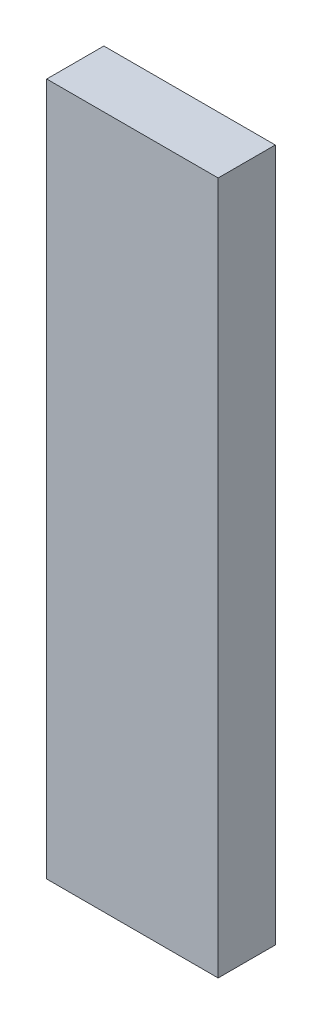
ISO-10303-21;
HEADER;
FILE_DESCRIPTION(('STEP AP214'),'2;1');
FILE_NAME('part.step','',(''),(''),'','','');
FILE_SCHEMA(('AUTOMOTIVE_DESIGN { 1 0 10303 214 1 1 1 1 }'));
ENDSEC;
DATA;
#1=APPLICATION_CONTEXT('core data for automotive mechanical design processes');
#2=APPLICATION_PROTOCOL_DEFINITION('international standard','automotive_design',2000,#1);
#3=PRODUCT_CONTEXT('',#1,'mechanical');
#4=PRODUCT('Part','Part','',(#3));
#5=PRODUCT_RELATED_PRODUCT_CATEGORY('part','',(#4));
#6=PRODUCT_DEFINITION_FORMATION('','',#4);
#7=PRODUCT_DEFINITION_CONTEXT('part definition',#1,'design');
#8=PRODUCT_DEFINITION('design','',#6,#7);
#9=PRODUCT_DEFINITION_SHAPE('','',#8);
#10=(LENGTH_UNIT() NAMED_UNIT(*) SI_UNIT(.MILLI.,.METRE.));
#11=(NAMED_UNIT(*) PLANE_ANGLE_UNIT() SI_UNIT($,.RADIAN.));
#12=(NAMED_UNIT(*) SI_UNIT($,.STERADIAN.) SOLID_ANGLE_UNIT());
#13=UNCERTAINTY_MEASURE_WITH_UNIT(LENGTH_MEASURE(1.E-05),#10,'distance_accuracy_value','');
#14=(GEOMETRIC_REPRESENTATION_CONTEXT(3) GLOBAL_UNCERTAINTY_ASSIGNED_CONTEXT((#13)) GLOBAL_UNIT_ASSIGNED_CONTEXT((#10,
#11,#12)) REPRESENTATION_CONTEXT('',''));
#15=CARTESIAN_POINT('',(0.,0.,0.));
#16=DIRECTION('',(0.,0.,1.));
#17=DIRECTION('',(1.,0.,0.));
#18=AXIS2_PLACEMENT_3D('',#15,#16,#17);
#19=CARTESIAN_POINT('',(0.,154.,0.));
#20=DIRECTION('',(1.,0.,0.));
#21=DIRECTION('',(0.,0.,-1.));
#22=AXIS2_PLACEMENT_3D('',#19,#20,#21);
#23=PLANE('',#22);
#24=DIRECTION('',(0.,0.,1.));
#25=VECTOR('',#24,1.);
#26=CARTESIAN_POINT('',(0.,0.,0.));
#27=LINE('',#26,#25);
#28=CARTESIAN_POINT('',(0.,0.,-12.7));
#29=VERTEX_POINT('',#28);
#30=CARTESIAN_POINT('',(0.,0.,0.));
#31=VERTEX_POINT('',#30);
#32=EDGE_CURVE('E107',#29,#31,#27,.T.);
#33=ORIENTED_EDGE('',*,*,#32,.T.);
#34=DIRECTION('',(0.,-1.,0.));
#35=VECTOR('',#34,1.);
#36=CARTESIAN_POINT('',(0.,154.,0.));
#37=LINE('',#36,#35);
#38=CARTESIAN_POINT('',(0.,154.,0.));
#39=VERTEX_POINT('',#38);
#40=EDGE_CURVE('E11',#39,#31,#37,.T.);
#41=ORIENTED_EDGE('',*,*,#40,.F.);
#42=DIRECTION('',(0.,0.,1.));
#43=VECTOR('',#42,1.);
#44=CARTESIAN_POINT('',(0.,154.,0.));
#45=LINE('',#44,#43);
#46=CARTESIAN_POINT('',(0.,154.,-12.7));
#47=VERTEX_POINT('',#46);
#48=EDGE_CURVE('E91',#47,#39,#45,.T.);
#49=ORIENTED_EDGE('',*,*,#48,.F.);
#50=DIRECTION('',(0.,-1.,0.));
#51=VECTOR('',#50,1.);
#52=CARTESIAN_POINT('',(0.,154.,-12.7));
#53=LINE('',#52,#51);
#54=EDGE_CURVE('E103',#47,#29,#53,.T.);
#55=ORIENTED_EDGE('',*,*,#54,.T.);
#56=EDGE_LOOP('',(#33,#41,#49,#55));
#57=FACE_BOUND('',#56,.T.);
#58=ADVANCED_FACE('F39',(#57),#23,.F.);
#59=CARTESIAN_POINT('',(0.,154.,0.));
#60=DIRECTION('',(0.,0.,-1.));
#61=DIRECTION('',(-1.,0.,0.));
#62=AXIS2_PLACEMENT_3D('',#59,#60,#61);
#63=PLANE('',#62);
#64=DIRECTION('',(1.,0.,0.));
#65=VECTOR('',#64,1.);
#66=CARTESIAN_POINT('',(0.,0.,0.));
#67=LINE('',#66,#65);
#68=CARTESIAN_POINT('',(38.1,0.,0.));
#69=VERTEX_POINT('',#68);
#70=EDGE_CURVE('E96',#31,#69,#67,.T.);
#71=ORIENTED_EDGE('',*,*,#70,.T.);
#72=DIRECTION('',(0.,-1.,0.));
#73=VECTOR('',#72,1.);
#74=CARTESIAN_POINT('',(38.1,154.,0.));
#75=LINE('',#74,#73);
#76=CARTESIAN_POINT('',(38.1,154.,0.));
#77=VERTEX_POINT('',#76);
#78=EDGE_CURVE('E48',#77,#69,#75,.T.);
#79=ORIENTED_EDGE('',*,*,#78,.F.);
#80=DIRECTION('',(1.,0.,0.));
#81=VECTOR('',#80,1.);
#82=CARTESIAN_POINT('',(0.,154.,0.));
#83=LINE('',#82,#81);
#84=EDGE_CURVE('E86',#39,#77,#83,.T.);
#85=ORIENTED_EDGE('',*,*,#84,.F.);
#86=ORIENTED_EDGE('',*,*,#40,.T.);
#87=EDGE_LOOP('',(#71,#79,#85,#86));
#88=FACE_BOUND('',#87,.T.);
#89=ADVANCED_FACE('F95',(#88),#63,.F.);
#90=CARTESIAN_POINT('',(38.1,154.,0.));
#91=DIRECTION('',(-1.,0.,0.));
#92=DIRECTION('',(0.,0.,1.));
#93=AXIS2_PLACEMENT_3D('',#90,#91,#92);
#94=PLANE('',#93);
#95=DIRECTION('',(0.,0.,-1.));
#96=VECTOR('',#95,1.);
#97=CARTESIAN_POINT('',(38.1,0.,0.));
#98=LINE('',#97,#96);
#99=CARTESIAN_POINT('',(38.1,0.,-12.7));
#100=VERTEX_POINT('',#99);
#101=EDGE_CURVE('E73',#69,#100,#98,.T.);
#102=ORIENTED_EDGE('',*,*,#101,.T.);
#103=DIRECTION('',(0.,-1.,0.));
#104=VECTOR('',#103,1.);
#105=CARTESIAN_POINT('',(38.1,154.,-12.7));
#106=LINE('',#105,#104);
#107=CARTESIAN_POINT('',(38.1,154.,-12.7));
#108=VERTEX_POINT('',#107);
#109=EDGE_CURVE('E98',#108,#100,#106,.T.);
#110=ORIENTED_EDGE('',*,*,#109,.F.);
#111=DIRECTION('',(0.,0.,-1.));
#112=VECTOR('',#111,1.);
#113=CARTESIAN_POINT('',(38.1,154.,0.));
#114=LINE('',#113,#112);
#115=EDGE_CURVE('E89',#77,#108,#114,.T.);
#116=ORIENTED_EDGE('',*,*,#115,.F.);
#117=ORIENTED_EDGE('',*,*,#78,.T.);
#118=EDGE_LOOP('',(#102,#110,#116,#117));
#119=FACE_BOUND('',#118,.T.);
#120=ADVANCED_FACE('F99',(#119),#94,.F.);
#121=CARTESIAN_POINT('',(0.,154.,-12.7));
#122=DIRECTION('',(0.,0.,1.));
#123=DIRECTION('',(1.,0.,0.));
#124=AXIS2_PLACEMENT_3D('',#121,#122,#123);
#125=PLANE('',#124);
#126=DIRECTION('',(-1.,0.,0.));
#127=VECTOR('',#126,1.);
#128=CARTESIAN_POINT('',(0.,0.,-12.7));
#129=LINE('',#128,#127);
#130=EDGE_CURVE('E79',#100,#29,#129,.T.);
#131=ORIENTED_EDGE('',*,*,#130,.T.);
#132=ORIENTED_EDGE('',*,*,#54,.F.);
#133=DIRECTION('',(-1.,0.,0.));
#134=VECTOR('',#133,1.);
#135=CARTESIAN_POINT('',(0.,154.,-12.7));
#136=LINE('',#135,#134);
#137=EDGE_CURVE('E56',#108,#47,#136,.T.);
#138=ORIENTED_EDGE('',*,*,#137,.F.);
#139=ORIENTED_EDGE('',*,*,#109,.T.);
#140=EDGE_LOOP('',(#131,#132,#138,#139));
#141=FACE_BOUND('',#140,.T.);
#142=ADVANCED_FACE('F120',(#141),#125,.F.);
#143=CARTESIAN_POINT('',(0.,154.,0.));
#144=DIRECTION('',(0.,-1.,0.));
#145=DIRECTION('',(0.,0.,-1.));
#146=AXIS2_PLACEMENT_3D('',#143,#144,#145);
#147=PLANE('',#146);
#148=ORIENTED_EDGE('',*,*,#48,.T.);
#149=ORIENTED_EDGE('',*,*,#84,.T.);
#150=ORIENTED_EDGE('',*,*,#115,.T.);
#151=ORIENTED_EDGE('',*,*,#137,.T.);
#152=EDGE_LOOP('',(#148,#149,#150,#151));
#153=FACE_BOUND('',#152,.T.);
#154=ADVANCED_FACE('F87',(#153),#147,.F.);
#155=CARTESIAN_POINT('',(0.,0.,0.));
#156=DIRECTION('',(0.,-1.,0.));
#157=DIRECTION('',(0.,0.,-1.));
#158=AXIS2_PLACEMENT_3D('',#155,#156,#157);
#159=PLANE('',#158);
#160=ORIENTED_EDGE('',*,*,#32,.F.);
#161=ORIENTED_EDGE('',*,*,#130,.F.);
#162=ORIENTED_EDGE('',*,*,#101,.F.);
#163=ORIENTED_EDGE('',*,*,#70,.F.);
#164=EDGE_LOOP('',(#160,#161,#162,#163));
#165=FACE_BOUND('',#164,.T.);
#166=ADVANCED_FACE('F123',(#165),#159,.T.);
#167=CLOSED_SHELL('',(#58,#89,#120,#142,#154,#166));
#168=MANIFOLD_SOLID_BREP('B2',#167);
#169=ADVANCED_BREP_SHAPE_REPRESENTATION('',(#18,#168),#14);
#170=SHAPE_DEFINITION_REPRESENTATION(#9,#169);
ENDSEC;
END-ISO-10303-21;
